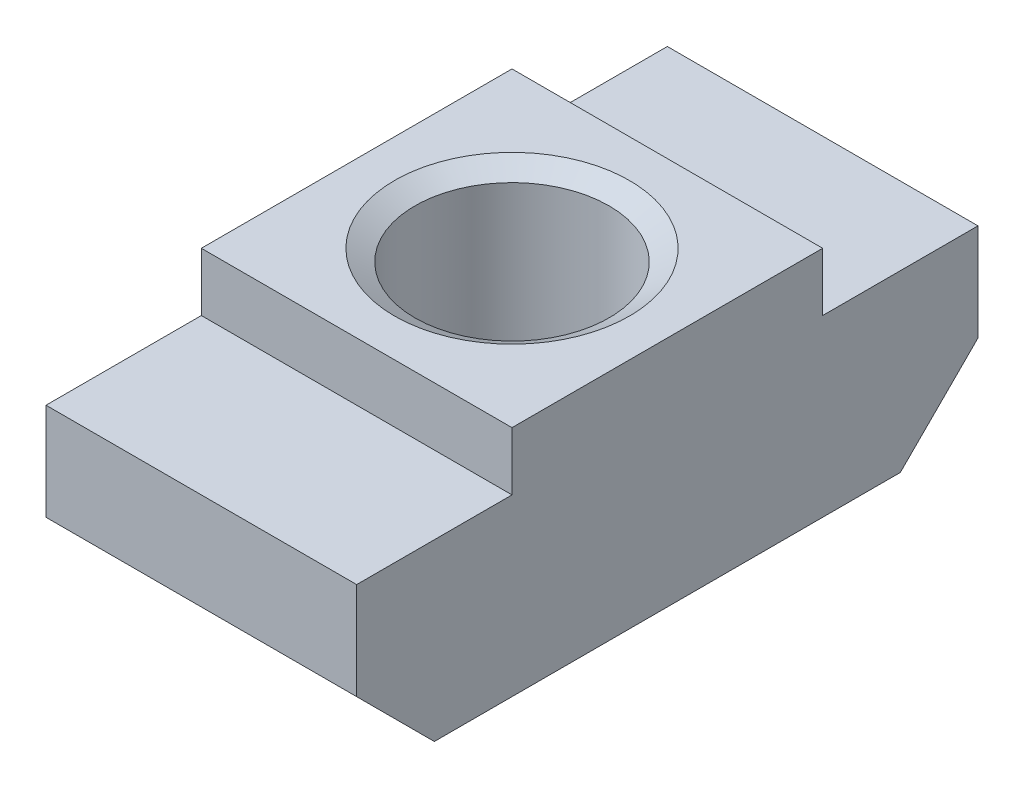
ISO-10303-21;
HEADER;
FILE_DESCRIPTION(('STEP AP214'),'2;1');
FILE_NAME('part.step','',(''),(''),'','','');
FILE_SCHEMA(('AUTOMOTIVE_DESIGN { 1 0 10303 214 1 1 1 1 }'));
ENDSEC;
DATA;
#1=APPLICATION_CONTEXT('core data for automotive mechanical design processes');
#2=APPLICATION_PROTOCOL_DEFINITION('international standard','automotive_design',2000,#1);
#3=PRODUCT_CONTEXT('',#1,'mechanical');
#4=PRODUCT('Part','Part','',(#3));
#5=PRODUCT_RELATED_PRODUCT_CATEGORY('part','',(#4));
#6=PRODUCT_DEFINITION_FORMATION('','',#4);
#7=PRODUCT_DEFINITION_CONTEXT('part definition',#1,'design');
#8=PRODUCT_DEFINITION('design','',#6,#7);
#9=PRODUCT_DEFINITION_SHAPE('','',#8);
#10=(LENGTH_UNIT() NAMED_UNIT(*) SI_UNIT(.MILLI.,.METRE.));
#11=(NAMED_UNIT(*) PLANE_ANGLE_UNIT() SI_UNIT($,.RADIAN.));
#12=(NAMED_UNIT(*) SI_UNIT($,.STERADIAN.) SOLID_ANGLE_UNIT());
#13=UNCERTAINTY_MEASURE_WITH_UNIT(LENGTH_MEASURE(1.E-05),#10,'distance_accuracy_value','');
#14=(GEOMETRIC_REPRESENTATION_CONTEXT(3) GLOBAL_UNCERTAINTY_ASSIGNED_CONTEXT((#13)) GLOBAL_UNIT_ASSIGNED_CONTEXT((#10,
#11,#12)) REPRESENTATION_CONTEXT('',''));
#15=CARTESIAN_POINT('',(0.,0.,0.));
#16=DIRECTION('',(0.,0.,1.));
#17=DIRECTION('',(1.,0.,0.));
#18=AXIS2_PLACEMENT_3D('',#15,#16,#17);
#19=CARTESIAN_POINT('',(4.,0.,16.));
#20=DIRECTION('',(-1.,0.,0.));
#21=DIRECTION('',(0.,0.,1.));
#22=AXIS2_PLACEMENT_3D('',#19,#20,#21);
#23=PLANE('',#22);
#24=DIRECTION('',(0.,0.,1.));
#25=VECTOR('',#24,1.);
#26=CARTESIAN_POINT('',(4.,4.5,16.));
#27=LINE('',#26,#25);
#28=CARTESIAN_POINT('',(4.,4.5,0.));
#29=VERTEX_POINT('',#28);
#30=CARTESIAN_POINT('',(4.,4.5,4.));
#31=VERTEX_POINT('',#30);
#32=EDGE_CURVE('E47',#29,#31,#27,.T.);
#33=ORIENTED_EDGE('',*,*,#32,.T.);
#34=DIRECTION('',(0.,1.,0.));
#35=VECTOR('',#34,1.);
#36=CARTESIAN_POINT('',(4.,0.,4.));
#37=LINE('',#36,#35);
#38=CARTESIAN_POINT('',(4.,6.,4.));
#39=VERTEX_POINT('',#38);
#40=EDGE_CURVE('E196',#31,#39,#37,.T.);
#41=ORIENTED_EDGE('',*,*,#40,.T.);
#42=DIRECTION('',(0.,0.,-1.));
#43=VECTOR('',#42,1.);
#44=CARTESIAN_POINT('',(4.,6.,16.));
#45=LINE('',#44,#43);
#46=CARTESIAN_POINT('',(4.,6.,12.));
#47=VERTEX_POINT('',#46);
#48=EDGE_CURVE('E143',#47,#39,#45,.T.);
#49=ORIENTED_EDGE('',*,*,#48,.F.);
#50=DIRECTION('',(0.,-1.,0.));
#51=VECTOR('',#50,1.);
#52=CARTESIAN_POINT('',(4.,0.,12.));
#53=LINE('',#52,#51);
#54=CARTESIAN_POINT('',(4.,4.5,12.));
#55=VERTEX_POINT('',#54);
#56=EDGE_CURVE('E183',#47,#55,#53,.T.);
#57=ORIENTED_EDGE('',*,*,#56,.T.);
#58=DIRECTION('',(0.,0.,1.));
#59=VECTOR('',#58,1.);
#60=CARTESIAN_POINT('',(4.,4.5,16.));
#61=LINE('',#60,#59);
#62=CARTESIAN_POINT('',(4.,4.5,16.));
#63=VERTEX_POINT('',#62);
#64=EDGE_CURVE('E186',#55,#63,#61,.T.);
#65=ORIENTED_EDGE('',*,*,#64,.T.);
#66=DIRECTION('',(0.,1.,0.));
#67=VECTOR('',#66,1.);
#68=CARTESIAN_POINT('',(4.,0.,16.));
#69=LINE('',#68,#67);
#70=CARTESIAN_POINT('',(4.,2.,16.));
#71=VERTEX_POINT('',#70);
#72=EDGE_CURVE('E127',#71,#63,#69,.T.);
#73=ORIENTED_EDGE('',*,*,#72,.F.);
#74=DIRECTION('',(0.,-0.707106781186548,-0.707106781186547));
#75=VECTOR('',#74,1.);
#76=CARTESIAN_POINT('',(4.,0.999999999999999,15.));
#77=LINE('',#76,#75);
#78=CARTESIAN_POINT('',(4.,0.,14.));
#79=VERTEX_POINT('',#78);
#80=EDGE_CURVE('E176',#71,#79,#77,.T.);
#81=ORIENTED_EDGE('',*,*,#80,.T.);
#82=DIRECTION('',(0.,0.,-1.));
#83=VECTOR('',#82,1.);
#84=CARTESIAN_POINT('',(4.,0.,16.));
#85=LINE('',#84,#83);
#86=CARTESIAN_POINT('',(4.,0.,2.));
#87=VERTEX_POINT('',#86);
#88=EDGE_CURVE('E137',#79,#87,#85,.T.);
#89=ORIENTED_EDGE('',*,*,#88,.T.);
#90=DIRECTION('',(0.,0.707106781186548,-0.707106781186547));
#91=VECTOR('',#90,1.);
#92=CARTESIAN_POINT('',(4.,-7.,9.));
#93=LINE('',#92,#91);
#94=CARTESIAN_POINT('',(4.,2.,0.));
#95=VERTEX_POINT('',#94);
#96=EDGE_CURVE('E168',#87,#95,#93,.T.);
#97=ORIENTED_EDGE('',*,*,#96,.T.);
#98=DIRECTION('',(0.,1.,0.));
#99=VECTOR('',#98,1.);
#100=CARTESIAN_POINT('',(4.,0.,0.));
#101=LINE('',#100,#99);
#102=EDGE_CURVE('E128',#95,#29,#101,.T.);
#103=ORIENTED_EDGE('',*,*,#102,.T.);
#104=EDGE_LOOP('',(#33,#41,#49,#57,#65,#73,#81,#89,#97,#103));
#105=FACE_BOUND('',#104,.T.);
#106=ADVANCED_FACE('F34',(#105),#23,.F.);
#107=CARTESIAN_POINT('',(-4.,6.,16.));
#108=DIRECTION('',(0.,-1.,0.));
#109=DIRECTION('',(0.,0.,-1.));
#110=AXIS2_PLACEMENT_3D('',#107,#108,#109);
#111=PLANE('',#110);
#112=CARTESIAN_POINT('',(0.,6.,8.));
#113=DIRECTION('',(0.,1.,0.));
#114=DIRECTION('',(0.,0.,1.));
#115=AXIS2_PLACEMENT_3D('',#112,#113,#114);
#116=CIRCLE('',#115,3.025);
#117=CARTESIAN_POINT('',(0.,6.,11.025));
#118=VERTEX_POINT('',#117);
#119=EDGE_CURVE('E165',#118,#118,#116,.T.);
#120=ORIENTED_EDGE('',*,*,#119,.F.);
#121=EDGE_LOOP('',(#120));
#122=FACE_BOUND('',#121,.T.);
#123=ORIENTED_EDGE('',*,*,#48,.T.);
#124=DIRECTION('',(-1.,0.,0.));
#125=VECTOR('',#124,1.);
#126=CARTESIAN_POINT('',(6.,6.,4.));
#127=LINE('',#126,#125);
#128=CARTESIAN_POINT('',(-4.,6.,4.));
#129=VERTEX_POINT('',#128);
#130=EDGE_CURVE('E200',#39,#129,#127,.T.);
#131=ORIENTED_EDGE('',*,*,#130,.T.);
#132=DIRECTION('',(0.,0.,-1.));
#133=VECTOR('',#132,1.);
#134=CARTESIAN_POINT('',(-4.,6.,16.));
#135=LINE('',#134,#133);
#136=CARTESIAN_POINT('',(-4.,6.,12.));
#137=VERTEX_POINT('',#136);
#138=EDGE_CURVE('E141',#137,#129,#135,.T.);
#139=ORIENTED_EDGE('',*,*,#138,.F.);
#140=DIRECTION('',(-1.,0.,0.));
#141=VECTOR('',#140,1.);
#142=CARTESIAN_POINT('',(6.,6.,12.));
#143=LINE('',#142,#141);
#144=EDGE_CURVE('E189',#47,#137,#143,.T.);
#145=ORIENTED_EDGE('',*,*,#144,.F.);
#146=EDGE_LOOP('',(#123,#131,#139,#145));
#147=FACE_BOUND('',#146,.T.);
#148=ADVANCED_FACE('F209',(#122,#147),#111,.F.);
#149=CARTESIAN_POINT('',(-4.,0.,16.));
#150=DIRECTION('',(1.,0.,0.));
#151=DIRECTION('',(0.,0.,-1.));
#152=AXIS2_PLACEMENT_3D('',#149,#150,#151);
#153=PLANE('',#152);
#154=ORIENTED_EDGE('',*,*,#138,.T.);
#155=DIRECTION('',(0.,1.,0.));
#156=VECTOR('',#155,1.);
#157=CARTESIAN_POINT('',(-4.,4.5,4.));
#158=LINE('',#157,#156);
#159=CARTESIAN_POINT('',(-4.,4.5,4.));
#160=VERTEX_POINT('',#159);
#161=EDGE_CURVE('E122',#160,#129,#158,.T.);
#162=ORIENTED_EDGE('',*,*,#161,.F.);
#163=DIRECTION('',(0.,0.,1.));
#164=VECTOR('',#163,1.);
#165=CARTESIAN_POINT('',(-4.,4.5,0.));
#166=LINE('',#165,#164);
#167=CARTESIAN_POINT('',(-4.,4.5,0.));
#168=VERTEX_POINT('',#167);
#169=EDGE_CURVE('E110',#168,#160,#166,.T.);
#170=ORIENTED_EDGE('',*,*,#169,.F.);
#171=DIRECTION('',(0.,-1.,0.));
#172=VECTOR('',#171,1.);
#173=CARTESIAN_POINT('',(-4.,0.,0.));
#174=LINE('',#173,#172);
#175=CARTESIAN_POINT('',(-4.,2.,0.));
#176=VERTEX_POINT('',#175);
#177=EDGE_CURVE('E120',#168,#176,#174,.T.);
#178=ORIENTED_EDGE('',*,*,#177,.T.);
#179=DIRECTION('',(0.,0.707106781186548,-0.707106781186547));
#180=VECTOR('',#179,1.);
#181=CARTESIAN_POINT('',(-4.,2.,0.));
#182=LINE('',#181,#180);
#183=CARTESIAN_POINT('',(-4.,0.,2.));
#184=VERTEX_POINT('',#183);
#185=EDGE_CURVE('E174',#184,#176,#182,.T.);
#186=ORIENTED_EDGE('',*,*,#185,.F.);
#187=DIRECTION('',(0.,0.,-1.));
#188=VECTOR('',#187,1.);
#189=CARTESIAN_POINT('',(-4.,0.,16.));
#190=LINE('',#189,#188);
#191=CARTESIAN_POINT('',(-4.,0.,14.));
#192=VERTEX_POINT('',#191);
#193=EDGE_CURVE('E139',#192,#184,#190,.T.);
#194=ORIENTED_EDGE('',*,*,#193,.F.);
#195=DIRECTION('',(0.,-0.707106781186548,-0.707106781186547));
#196=VECTOR('',#195,1.);
#197=CARTESIAN_POINT('',(-4.,2.,16.));
#198=LINE('',#197,#196);
#199=CARTESIAN_POINT('',(-4.,2.,16.));
#200=VERTEX_POINT('',#199);
#201=EDGE_CURVE('E158',#200,#192,#198,.T.);
#202=ORIENTED_EDGE('',*,*,#201,.F.);
#203=DIRECTION('',(0.,-1.,0.));
#204=VECTOR('',#203,1.);
#205=CARTESIAN_POINT('',(-4.,0.,16.));
#206=LINE('',#205,#204);
#207=CARTESIAN_POINT('',(-4.,4.5,16.));
#208=VERTEX_POINT('',#207);
#209=EDGE_CURVE('E131',#208,#200,#206,.T.);
#210=ORIENTED_EDGE('',*,*,#209,.F.);
#211=DIRECTION('',(0.,0.,1.));
#212=VECTOR('',#211,1.);
#213=CARTESIAN_POINT('',(-4.,4.5,16.));
#214=LINE('',#213,#212);
#215=CARTESIAN_POINT('',(-4.,4.5,12.));
#216=VERTEX_POINT('',#215);
#217=EDGE_CURVE('E55',#216,#208,#214,.T.);
#218=ORIENTED_EDGE('',*,*,#217,.F.);
#219=DIRECTION('',(0.,-1.,0.));
#220=VECTOR('',#219,1.);
#221=CARTESIAN_POINT('',(-4.,4.5,12.));
#222=LINE('',#221,#220);
#223=EDGE_CURVE('E193',#137,#216,#222,.T.);
#224=ORIENTED_EDGE('',*,*,#223,.F.);
#225=EDGE_LOOP('',(#154,#162,#170,#178,#186,#194,#202,#210,#218,#224));
#226=FACE_BOUND('',#225,.T.);
#227=ADVANCED_FACE('F118',(#226),#153,.F.);
#228=CARTESIAN_POINT('',(-4.,0.,16.));
#229=DIRECTION('',(0.,1.,0.));
#230=DIRECTION('',(0.,0.,1.));
#231=AXIS2_PLACEMENT_3D('',#228,#229,#230);
#232=PLANE('',#231);
#233=CARTESIAN_POINT('',(0.,0.,8.));
#234=DIRECTION('',(0.,1.,0.));
#235=DIRECTION('',(0.,0.,1.));
#236=AXIS2_PLACEMENT_3D('',#233,#234,#235);
#237=CIRCLE('',#236,2.5);
#238=CARTESIAN_POINT('',(0.,0.,10.5));
#239=VERTEX_POINT('',#238);
#240=EDGE_CURVE('E133',#239,#239,#237,.T.);
#241=ORIENTED_EDGE('',*,*,#240,.T.);
#242=EDGE_LOOP('',(#241));
#243=FACE_BOUND('',#242,.T.);
#244=ORIENTED_EDGE('',*,*,#88,.F.);
#245=DIRECTION('',(-1.,0.,0.));
#246=VECTOR('',#245,1.);
#247=CARTESIAN_POINT('',(6.,0.,14.));
#248=LINE('',#247,#246);
#249=EDGE_CURVE('E179',#79,#192,#248,.T.);
#250=ORIENTED_EDGE('',*,*,#249,.T.);
#251=ORIENTED_EDGE('',*,*,#193,.T.);
#252=DIRECTION('',(-1.,0.,0.));
#253=VECTOR('',#252,1.);
#254=CARTESIAN_POINT('',(6.,0.,2.));
#255=LINE('',#254,#253);
#256=EDGE_CURVE('E171',#87,#184,#255,.T.);
#257=ORIENTED_EDGE('',*,*,#256,.F.);
#258=EDGE_LOOP('',(#244,#250,#251,#257));
#259=FACE_BOUND('',#258,.T.);
#260=ADVANCED_FACE('F222',(#243,#259),#232,.F.);
#261=CARTESIAN_POINT('',(0.,0.,16.));
#262=DIRECTION('',(0.,0.,-1.));
#263=DIRECTION('',(-1.,0.,0.));
#264=AXIS2_PLACEMENT_3D('',#261,#262,#263);
#265=PLANE('',#264);
#266=ORIENTED_EDGE('',*,*,#72,.T.);
#267=DIRECTION('',(-1.,0.,0.));
#268=VECTOR('',#267,1.);
#269=CARTESIAN_POINT('',(0.,4.5,16.));
#270=LINE('',#269,#268);
#271=EDGE_CURVE('E41',#63,#208,#270,.T.);
#272=ORIENTED_EDGE('',*,*,#271,.T.);
#273=ORIENTED_EDGE('',*,*,#209,.T.);
#274=DIRECTION('',(1.,0.,0.));
#275=VECTOR('',#274,1.);
#276=CARTESIAN_POINT('',(0.,2.,16.));
#277=LINE('',#276,#275);
#278=EDGE_CURVE('E147',#200,#71,#277,.T.);
#279=ORIENTED_EDGE('',*,*,#278,.T.);
#280=EDGE_LOOP('',(#266,#272,#273,#279));
#281=FACE_BOUND('',#280,.T.);
#282=ADVANCED_FACE('F151',(#281),#265,.F.);
#283=CARTESIAN_POINT('',(0.,0.,0.));
#284=DIRECTION('',(0.,0.,-1.));
#285=DIRECTION('',(-1.,0.,0.));
#286=AXIS2_PLACEMENT_3D('',#283,#284,#285);
#287=PLANE('',#286);
#288=DIRECTION('',(-1.,0.,0.));
#289=VECTOR('',#288,1.);
#290=CARTESIAN_POINT('',(0.,4.5,0.));
#291=LINE('',#290,#289);
#292=EDGE_CURVE('E11',#29,#168,#291,.T.);
#293=ORIENTED_EDGE('',*,*,#292,.F.);
#294=ORIENTED_EDGE('',*,*,#102,.F.);
#295=DIRECTION('',(1.,0.,0.));
#296=VECTOR('',#295,1.);
#297=CARTESIAN_POINT('',(0.,2.,0.));
#298=LINE('',#297,#296);
#299=EDGE_CURVE('E126',#176,#95,#298,.T.);
#300=ORIENTED_EDGE('',*,*,#299,.F.);
#301=ORIENTED_EDGE('',*,*,#177,.F.);
#302=EDGE_LOOP('',(#293,#294,#300,#301));
#303=FACE_BOUND('',#302,.T.);
#304=ADVANCED_FACE('F125',(#303),#287,.T.);
#305=CARTESIAN_POINT('',(0.,6.,8.));
#306=DIRECTION('',(0.,1.,0.));
#307=DIRECTION('',(0.,0.,1.));
#308=AXIS2_PLACEMENT_3D('',#305,#306,#307);
#309=CYLINDRICAL_SURFACE('',#308,2.5);
#310=ORIENTED_EDGE('',*,*,#240,.F.);
#311=EDGE_LOOP('',(#310));
#312=FACE_BOUND('',#311,.T.);
#313=CARTESIAN_POINT('',(0.,5.69689110867544,8.));
#314=DIRECTION('',(0.,1.,0.));
#315=DIRECTION('',(0.,0.,1.));
#316=AXIS2_PLACEMENT_3D('',#313,#314,#315);
#317=CIRCLE('',#316,2.5);
#318=CARTESIAN_POINT('',(0.,5.69689110867544,10.5));
#319=VERTEX_POINT('',#318);
#320=EDGE_CURVE('E162',#319,#319,#317,.T.);
#321=ORIENTED_EDGE('',*,*,#320,.T.);
#322=EDGE_LOOP('',(#321));
#323=FACE_BOUND('',#322,.T.);
#324=ADVANCED_FACE('F251',(#312,#323),#309,.F.);
#325=CARTESIAN_POINT('',(0.,6.,8.));
#326=DIRECTION('',(0.,1.,0.));
#327=DIRECTION('',(0.,0.,1.));
#328=AXIS2_PLACEMENT_3D('',#325,#326,#327);
#329=CONICAL_SURFACE('',#328,3.025,1.0471975511966);
#330=ORIENTED_EDGE('',*,*,#320,.F.);
#331=EDGE_LOOP('',(#330));
#332=FACE_BOUND('',#331,.T.);
#333=ORIENTED_EDGE('',*,*,#119,.T.);
#334=EDGE_LOOP('',(#333));
#335=FACE_BOUND('',#334,.T.);
#336=ADVANCED_FACE('F256',(#332,#335),#329,.F.);
#337=CARTESIAN_POINT('',(6.,2.,0.));
#338=DIRECTION('',(0.,0.707106781186547,0.707106781186548));
#339=DIRECTION('',(0.,-0.707106781186548,0.707106781186547));
#340=AXIS2_PLACEMENT_3D('',#337,#338,#339);
#341=PLANE('',#340);
#342=ORIENTED_EDGE('',*,*,#256,.T.);
#343=ORIENTED_EDGE('',*,*,#185,.T.);
#344=ORIENTED_EDGE('',*,*,#299,.T.);
#345=ORIENTED_EDGE('',*,*,#96,.F.);
#346=EDGE_LOOP('',(#342,#343,#344,#345));
#347=FACE_BOUND('',#346,.T.);
#348=ADVANCED_FACE('F220',(#347),#341,.F.);
#349=CARTESIAN_POINT('',(6.,2.,16.));
#350=DIRECTION('',(0.,0.707106781186547,-0.707106781186548));
#351=DIRECTION('',(0.,0.707106781186548,0.707106781186547));
#352=AXIS2_PLACEMENT_3D('',#349,#350,#351);
#353=PLANE('',#352);
#354=ORIENTED_EDGE('',*,*,#278,.F.);
#355=ORIENTED_EDGE('',*,*,#201,.T.);
#356=ORIENTED_EDGE('',*,*,#249,.F.);
#357=ORIENTED_EDGE('',*,*,#80,.F.);
#358=EDGE_LOOP('',(#354,#355,#356,#357));
#359=FACE_BOUND('',#358,.T.);
#360=ADVANCED_FACE('F224',(#359),#353,.F.);
#361=CARTESIAN_POINT('',(6.,4.5,12.));
#362=DIRECTION('',(0.,0.,-1.));
#363=DIRECTION('',(-1.,0.,0.));
#364=AXIS2_PLACEMENT_3D('',#361,#362,#363);
#365=PLANE('',#364);
#366=ORIENTED_EDGE('',*,*,#144,.T.);
#367=ORIENTED_EDGE('',*,*,#223,.T.);
#368=DIRECTION('',(-1.,0.,0.));
#369=VECTOR('',#368,1.);
#370=CARTESIAN_POINT('',(6.,4.5,12.));
#371=LINE('',#370,#369);
#372=EDGE_CURVE('E188',#55,#216,#371,.T.);
#373=ORIENTED_EDGE('',*,*,#372,.F.);
#374=ORIENTED_EDGE('',*,*,#56,.F.);
#375=EDGE_LOOP('',(#366,#367,#373,#374));
#376=FACE_BOUND('',#375,.T.);
#377=ADVANCED_FACE('F214',(#376),#365,.F.);
#378=CARTESIAN_POINT('',(6.,4.5,16.));
#379=DIRECTION('',(0.,-1.,0.));
#380=DIRECTION('',(0.,0.,-1.));
#381=AXIS2_PLACEMENT_3D('',#378,#379,#380);
#382=PLANE('',#381);
#383=ORIENTED_EDGE('',*,*,#372,.T.);
#384=ORIENTED_EDGE('',*,*,#217,.T.);
#385=ORIENTED_EDGE('',*,*,#271,.F.);
#386=ORIENTED_EDGE('',*,*,#64,.F.);
#387=EDGE_LOOP('',(#383,#384,#385,#386));
#388=FACE_BOUND('',#387,.T.);
#389=ADVANCED_FACE('F225',(#388),#382,.F.);
#390=CARTESIAN_POINT('',(6.,4.5,4.));
#391=DIRECTION('',(0.,0.,1.));
#392=DIRECTION('',(1.,0.,0.));
#393=AXIS2_PLACEMENT_3D('',#390,#391,#392);
#394=PLANE('',#393);
#395=DIRECTION('',(-1.,0.,0.));
#396=VECTOR('',#395,1.);
#397=CARTESIAN_POINT('',(6.,4.5,4.));
#398=LINE('',#397,#396);
#399=EDGE_CURVE('E201',#31,#160,#398,.T.);
#400=ORIENTED_EDGE('',*,*,#399,.T.);
#401=ORIENTED_EDGE('',*,*,#161,.T.);
#402=ORIENTED_EDGE('',*,*,#130,.F.);
#403=ORIENTED_EDGE('',*,*,#40,.F.);
#404=EDGE_LOOP('',(#400,#401,#402,#403));
#405=FACE_BOUND('',#404,.T.);
#406=ADVANCED_FACE('F206',(#405),#394,.F.);
#407=CARTESIAN_POINT('',(6.,4.5,0.));
#408=DIRECTION('',(0.,-1.,0.));
#409=DIRECTION('',(0.,0.,-1.));
#410=AXIS2_PLACEMENT_3D('',#407,#408,#409);
#411=PLANE('',#410);
#412=ORIENTED_EDGE('',*,*,#292,.T.);
#413=ORIENTED_EDGE('',*,*,#169,.T.);
#414=ORIENTED_EDGE('',*,*,#399,.F.);
#415=ORIENTED_EDGE('',*,*,#32,.F.);
#416=EDGE_LOOP('',(#412,#413,#414,#415));
#417=FACE_BOUND('',#416,.T.);
#418=ADVANCED_FACE('F109',(#417),#411,.F.);
#419=CLOSED_SHELL('',(#106,#148,#227,#260,#282,#304,#324,#336,#348,#360,#377,#389,#406,#418));
#420=MANIFOLD_SOLID_BREP('B2',#419);
#421=ADVANCED_BREP_SHAPE_REPRESENTATION('',(#18,#420),#14);
#422=SHAPE_DEFINITION_REPRESENTATION(#9,#421);
ENDSEC;
END-ISO-10303-21;
